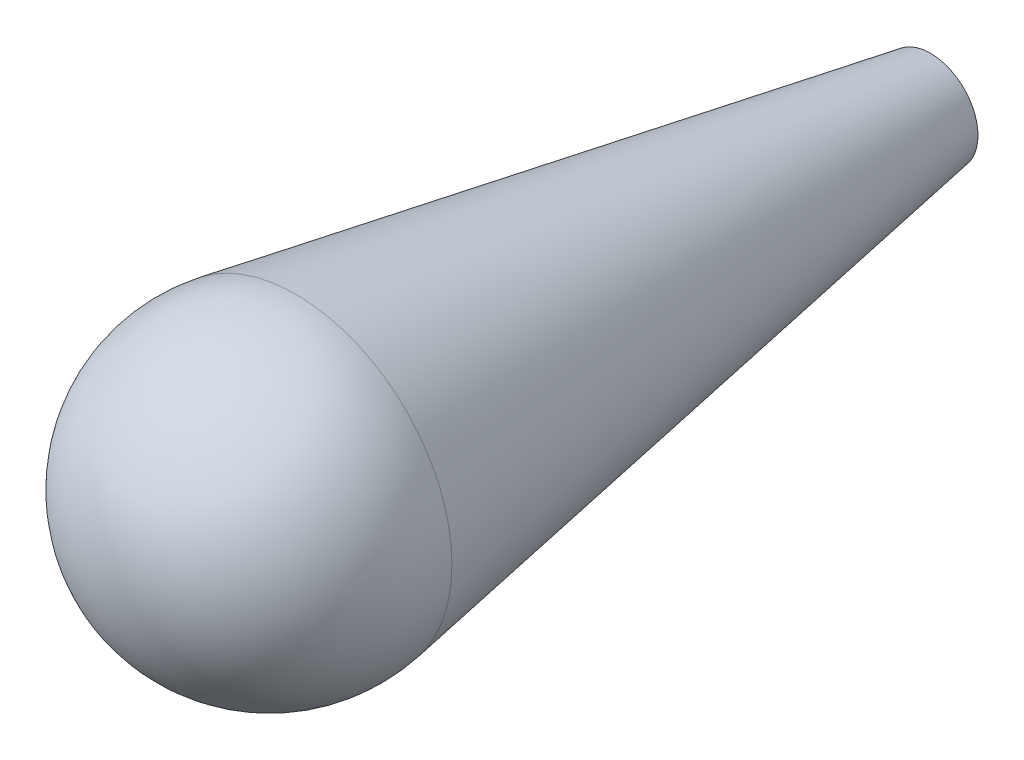
ISO-10303-21;
HEADER;
FILE_DESCRIPTION(('STEP AP214'),'2;1');
FILE_NAME('part.step','',(''),(''),'','','');
FILE_SCHEMA(('AUTOMOTIVE_DESIGN { 1 0 10303 214 1 1 1 1 }'));
ENDSEC;
DATA;
#1=APPLICATION_CONTEXT('core data for automotive mechanical design processes');
#2=APPLICATION_PROTOCOL_DEFINITION('international standard','automotive_design',2000,#1);
#3=PRODUCT_CONTEXT('',#1,'mechanical');
#4=PRODUCT('Part','Part','',(#3));
#5=PRODUCT_RELATED_PRODUCT_CATEGORY('part','',(#4));
#6=PRODUCT_DEFINITION_FORMATION('','',#4);
#7=PRODUCT_DEFINITION_CONTEXT('part definition',#1,'design');
#8=PRODUCT_DEFINITION('design','',#6,#7);
#9=PRODUCT_DEFINITION_SHAPE('','',#8);
#10=(LENGTH_UNIT() NAMED_UNIT(*) SI_UNIT(.MILLI.,.METRE.));
#11=(NAMED_UNIT(*) PLANE_ANGLE_UNIT() SI_UNIT($,.RADIAN.));
#12=(NAMED_UNIT(*) SI_UNIT($,.STERADIAN.) SOLID_ANGLE_UNIT());
#13=UNCERTAINTY_MEASURE_WITH_UNIT(LENGTH_MEASURE(1.E-05),#10,'distance_accuracy_value','');
#14=(GEOMETRIC_REPRESENTATION_CONTEXT(3) GLOBAL_UNCERTAINTY_ASSIGNED_CONTEXT((#13)) GLOBAL_UNIT_ASSIGNED_CONTEXT((#10,
#11,#12)) REPRESENTATION_CONTEXT('',''));
#15=CARTESIAN_POINT('',(0.,0.,0.));
#16=DIRECTION('',(0.,0.,1.));
#17=DIRECTION('',(1.,0.,0.));
#18=AXIS2_PLACEMENT_3D('',#15,#16,#17);
#19=CARTESIAN_POINT('',(0.,0.,0.));
#20=DIRECTION('',(0.,0.,1.));
#21=DIRECTION('',(1.,0.,0.));
#22=AXIS2_PLACEMENT_3D('',#19,#20,#21);
#23=CYLINDRICAL_SURFACE('',#22,3.);
#24=CARTESIAN_POINT('',(0.,0.,-41.8083351676824));
#25=DIRECTION('',(0.,0.,1.));
#26=DIRECTION('',(1.,0.,0.));
#27=AXIS2_PLACEMENT_3D('',#24,#25,#26);
#28=CIRCLE('',#27,3.);
#29=CARTESIAN_POINT('',(3.,0.,-41.8083351676824));
#30=VERTEX_POINT('',#29);
#31=EDGE_CURVE('E46',#30,#30,#28,.T.);
#32=ORIENTED_EDGE('',*,*,#31,.F.);
#33=EDGE_LOOP('',(#32));
#34=FACE_BOUND('',#33,.T.);
#35=CARTESIAN_POINT('',(0.,0.,0.));
#36=DIRECTION('',(0.,0.,1.));
#37=DIRECTION('',(1.,0.,0.));
#38=AXIS2_PLACEMENT_3D('',#35,#36,#37);
#39=CIRCLE('',#38,3.);
#40=CARTESIAN_POINT('',(3.,0.,0.));
#41=VERTEX_POINT('',#40);
#42=EDGE_CURVE('E50',#41,#41,#39,.F.);
#43=ORIENTED_EDGE('',*,*,#42,.F.);
#44=EDGE_LOOP('',(#43));
#45=FACE_BOUND('',#44,.T.);
#46=ADVANCED_FACE('F39',(#34,#45),#23,.F.);
#47=CARTESIAN_POINT('',(0.,0.,-41.8083351676824));
#48=DIRECTION('',(0.,0.,1.));
#49=DIRECTION('',(1.,0.,0.));
#50=AXIS2_PLACEMENT_3D('',#47,#48,#49);
#51=CONICAL_SURFACE('',#50,3.,0.169263259774982);
#52=CARTESIAN_POINT('',(0.,0.,-1.68456183274815));
#53=DIRECTION('',(0.,0.,1.));
#54=DIRECTION('',(1.,0.,0.));
#55=AXIS2_PLACEMENT_3D('',#52,#53,#54);
#56=CIRCLE('',#55,9.85709142859334);
#57=CARTESIAN_POINT('',(9.85709142859334,0.,-1.68456183274815));
#58=VERTEX_POINT('',#57);
#59=EDGE_CURVE('E10',#58,#58,#56,.F.);
#60=ORIENTED_EDGE('',*,*,#59,.T.);
#61=EDGE_LOOP('',(#60));
#62=FACE_BOUND('',#61,.T.);
#63=ORIENTED_EDGE('',*,*,#31,.T.);
#64=EDGE_LOOP('',(#63));
#65=FACE_BOUND('',#64,.T.);
#66=ADVANCED_FACE('F60',(#62,#65),#51,.T.);
#67=CARTESIAN_POINT('',(0.,0.,0.));
#68=DIRECTION('',(0.414324025925015,-0.910129442190114,0.));
#69=DIRECTION('',(0.910129442190114,0.414324025925015,0.));
#70=AXIS2_PLACEMENT_3D('',#67,#68,#69);
#71=SPHERICAL_SURFACE('',#70,10.);
#72=CARTESIAN_POINT('',(0.,0.,0.));
#73=DIRECTION('',(0.,0.,1.));
#74=DIRECTION('',(1.,0.,0.));
#75=AXIS2_PLACEMENT_3D('',#72,#73,#74);
#76=SPHERICAL_SURFACE('',#75,10.);
#77=ORIENTED_EDGE('',*,*,#59,.F.);
#78=EDGE_LOOP('',(#77));
#79=FACE_BOUND('',#78,.T.);
#80=ADVANCED_FACE('F41',(#79),#76,.T.);
#81=CARTESIAN_POINT('',(0.,0.,0.));
#82=DIRECTION('',(0.,0.,1.));
#83=DIRECTION('',(1.,0.,0.));
#84=AXIS2_PLACEMENT_3D('',#81,#82,#83);
#85=PLANE('',#84);
#86=ORIENTED_EDGE('',*,*,#42,.T.);
#87=EDGE_LOOP('',(#86));
#88=FACE_BOUND('',#87,.T.);
#89=ADVANCED_FACE('F57',(#88),#85,.F.);
#90=CLOSED_SHELL('',(#46,#66,#80,#89));
#91=MANIFOLD_SOLID_BREP('B2',#90);
#92=ADVANCED_BREP_SHAPE_REPRESENTATION('',(#18,#91),#14);
#93=SHAPE_DEFINITION_REPRESENTATION(#9,#92);
ENDSEC;
END-ISO-10303-21;
